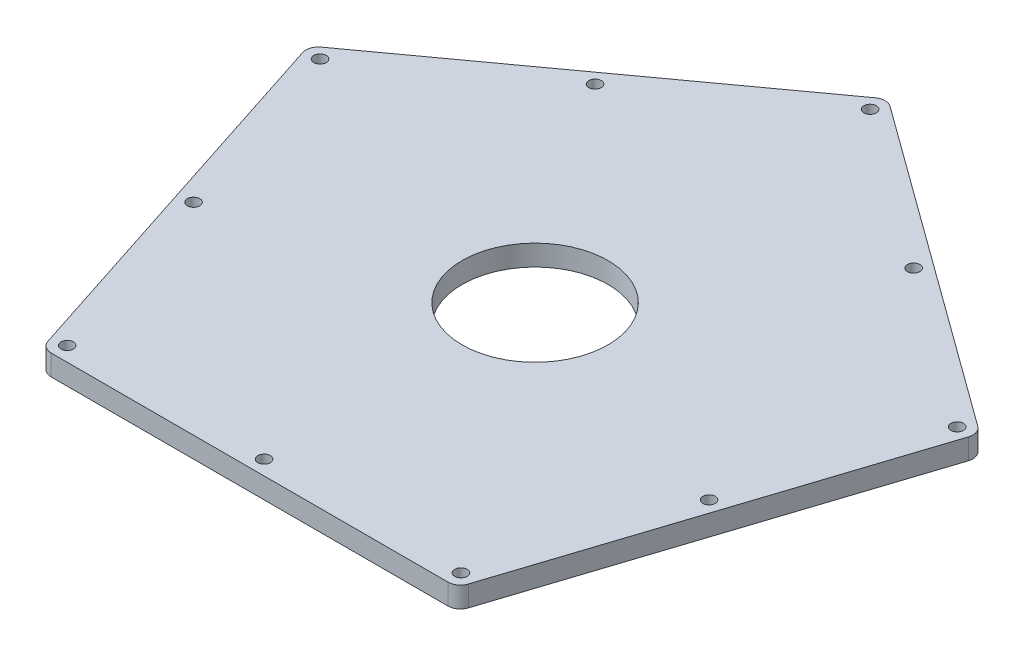
ISO-10303-21;
HEADER;
FILE_DESCRIPTION(('STEP AP214'),'2;1');
FILE_NAME('part.step','',(''),(''),'','','');
FILE_SCHEMA(('AUTOMOTIVE_DESIGN { 1 0 10303 214 1 1 1 1 }'));
ENDSEC;
DATA;
#1=APPLICATION_CONTEXT('core data for automotive mechanical design processes');
#2=APPLICATION_PROTOCOL_DEFINITION('international standard','automotive_design',2000,#1);
#3=PRODUCT_CONTEXT('',#1,'mechanical');
#4=PRODUCT('Part','Part','',(#3));
#5=PRODUCT_RELATED_PRODUCT_CATEGORY('part','',(#4));
#6=PRODUCT_DEFINITION_FORMATION('','',#4);
#7=PRODUCT_DEFINITION_CONTEXT('part definition',#1,'design');
#8=PRODUCT_DEFINITION('design','',#6,#7);
#9=PRODUCT_DEFINITION_SHAPE('','',#8);
#10=(LENGTH_UNIT() NAMED_UNIT(*) SI_UNIT(.MILLI.,.METRE.));
#11=(NAMED_UNIT(*) PLANE_ANGLE_UNIT() SI_UNIT($,.RADIAN.));
#12=(NAMED_UNIT(*) SI_UNIT($,.STERADIAN.) SOLID_ANGLE_UNIT());
#13=UNCERTAINTY_MEASURE_WITH_UNIT(LENGTH_MEASURE(1.E-05),#10,'distance_accuracy_value','');
#14=(GEOMETRIC_REPRESENTATION_CONTEXT(3) GLOBAL_UNCERTAINTY_ASSIGNED_CONTEXT((#13)) GLOBAL_UNIT_ASSIGNED_CONTEXT((#10,
#11,#12)) REPRESENTATION_CONTEXT('',''));
#15=CARTESIAN_POINT('',(0.,0.,0.));
#16=DIRECTION('',(0.,0.,1.));
#17=DIRECTION('',(1.,0.,0.));
#18=AXIS2_PLACEMENT_3D('',#15,#16,#17);
#19=CARTESIAN_POINT('',(0.,-5.,0.));
#20=DIRECTION('',(0.,1.,0.));
#21=DIRECTION('',(0.,0.,1.));
#22=AXIS2_PLACEMENT_3D('',#19,#20,#21);
#23=PLANE('',#22);
#24=CARTESIAN_POINT('',(0.,-5.,0.));
#25=DIRECTION('',(0.,1.,0.));
#26=DIRECTION('',(0.,0.,1.));
#27=AXIS2_PLACEMENT_3D('',#24,#25,#26);
#28=CIRCLE('',#27,17.6);
#29=CARTESIAN_POINT('',(0.,-5.,17.6));
#30=VERTEX_POINT('',#29);
#31=EDGE_CURVE('E325',#30,#30,#28,.T.);
#32=ORIENTED_EDGE('',*,*,#31,.F.);
#33=EDGE_LOOP('',(#32));
#34=FACE_BOUND('',#33,.T.);
#35=CARTESIAN_POINT('',(76.7872026714474,-5.,-24.9496745665813));
#36=DIRECTION('',(0.,1.,0.));
#37=DIRECTION('',(0.,0.,1.));
#38=AXIS2_PLACEMENT_3D('',#35,#36,#37);
#39=CIRCLE('',#38,1.5);
#40=CARTESIAN_POINT('',(76.7872026714474,-5.,-23.4496745665813));
#41=VERTEX_POINT('',#40);
#42=EDGE_CURVE('E305',#41,#41,#39,.T.);
#43=ORIENTED_EDGE('',*,*,#42,.F.);
#44=EDGE_LOOP('',(#43));
#45=FACE_BOUND('',#44,.T.);
#46=CARTESIAN_POINT('',(-38.3936013357237,-5.,-52.844258740268));
#47=DIRECTION('',(0.,1.,0.));
#48=DIRECTION('',(0.,0.,1.));
#49=AXIS2_PLACEMENT_3D('',#46,#47,#48);
#50=CIRCLE('',#49,1.5);
#51=CARTESIAN_POINT('',(-38.3936013357237,-5.,-51.344258740268));
#52=VERTEX_POINT('',#51);
#53=EDGE_CURVE('E289',#52,#52,#50,.T.);
#54=ORIENTED_EDGE('',*,*,#53,.F.);
#55=EDGE_LOOP('',(#54));
#56=FACE_BOUND('',#55,.T.);
#57=CARTESIAN_POINT('',(-62.1221519117143,-5.,20.1847107284887));
#58=DIRECTION('',(0.,1.,0.));
#59=DIRECTION('',(0.,0.,1.));
#60=AXIS2_PLACEMENT_3D('',#57,#58,#59);
#61=CIRCLE('',#60,1.5);
#62=CARTESIAN_POINT('',(-62.1221519117143,-5.,21.6847107284887));
#63=VERTEX_POINT('',#62);
#64=EDGE_CURVE('E273',#63,#63,#61,.T.);
#65=ORIENTED_EDGE('',*,*,#64,.F.);
#66=EDGE_LOOP('',(#65));
#67=FACE_BOUND('',#66,.T.);
#68=CARTESIAN_POINT('',(0.,-5.,65.3190960235587));
#69=DIRECTION('',(0.,1.,0.));
#70=DIRECTION('',(0.,0.,1.));
#71=AXIS2_PLACEMENT_3D('',#68,#69,#70);
#72=CIRCLE('',#71,1.5);
#73=CARTESIAN_POINT('',(0.,-5.,66.8190960235587));
#74=VERTEX_POINT('',#73);
#75=EDGE_CURVE('E257',#74,#74,#72,.T.);
#76=ORIENTED_EDGE('',*,*,#75,.F.);
#77=EDGE_LOOP('',(#76));
#78=FACE_BOUND('',#77,.T.);
#79=CARTESIAN_POINT('',(62.1221519117143,-5.,20.1847107284887));
#80=DIRECTION('',(0.,1.,0.));
#81=DIRECTION('',(0.,0.,1.));
#82=AXIS2_PLACEMENT_3D('',#79,#80,#81);
#83=CIRCLE('',#82,1.49999999999999);
#84=CARTESIAN_POINT('',(62.1221519117143,-5.,21.6847107284887));
#85=VERTEX_POINT('',#84);
#86=EDGE_CURVE('E232',#85,#85,#83,.T.);
#87=ORIENTED_EDGE('',*,*,#86,.F.);
#88=EDGE_LOOP('',(#87));
#89=FACE_BOUND('',#88,.T.);
#90=DIRECTION('',(0.309016994374947,0.,0.951056516295154));
#91=VECTOR('',#90,1.);
#92=CARTESIAN_POINT('',(-80.9016994374948,-5.,-26.2865556059567));
#93=LINE('',#92,#91);
#94=CARTESIAN_POINT('',(-80.2281574726254,-5.,-24.2136065890815));
#95=VERTEX_POINT('',#94);
#96=CARTESIAN_POINT('',(-50.6735419648694,-5.,66.7461470066835));
#97=VERTEX_POINT('',#96);
#98=EDGE_CURVE('E237',#95,#97,#93,.T.);
#99=ORIENTED_EDGE('',*,*,#98,.T.);
#100=CARTESIAN_POINT('',(-47.8203724159839,-5.,65.8190960235587));
#101=DIRECTION('',(0.,1.,0.));
#102=DIRECTION('',(0.,0.,1.));
#103=AXIS2_PLACEMENT_3D('',#100,#101,#102);
#104=CIRCLE('',#103,3.);
#105=CARTESIAN_POINT('',(-47.8203724159839,-5.,68.8190960235587));
#106=VERTEX_POINT('',#105);
#107=EDGE_CURVE('E191',#97,#106,#104,.T.);
#108=ORIENTED_EDGE('',*,*,#107,.T.);
#109=DIRECTION('',(1.,0.,0.));
#110=VECTOR('',#109,1.);
#111=CARTESIAN_POINT('',(-50.,-5.,68.8190960235587));
#112=LINE('',#111,#110);
#113=CARTESIAN_POINT('',(47.8203724159839,-5.,68.8190960235587));
#114=VERTEX_POINT('',#113);
#115=EDGE_CURVE('E142',#106,#114,#112,.T.);
#116=ORIENTED_EDGE('',*,*,#115,.T.);
#117=CARTESIAN_POINT('',(47.8203724159839,-5.,65.8190960235587));
#118=DIRECTION('',(0.,1.,0.));
#119=DIRECTION('',(0.,0.,1.));
#120=AXIS2_PLACEMENT_3D('',#117,#118,#119);
#121=CIRCLE('',#120,3.);
#122=CARTESIAN_POINT('',(50.6735419648694,-5.,66.7461470066835));
#123=VERTEX_POINT('',#122);
#124=EDGE_CURVE('E183',#114,#123,#121,.T.);
#125=ORIENTED_EDGE('',*,*,#124,.T.);
#126=DIRECTION('',(0.309016994374948,0.,-0.951056516295154));
#127=VECTOR('',#126,1.);
#128=CARTESIAN_POINT('',(50.,-5.,68.8190960235587));
#129=LINE('',#128,#127);
#130=CARTESIAN_POINT('',(80.2281574726254,-5.,-24.2136065890815));
#131=VERTEX_POINT('',#130);
#132=EDGE_CURVE('E152',#123,#131,#129,.T.);
#133=ORIENTED_EDGE('',*,*,#132,.T.);
#134=CARTESIAN_POINT('',(77.3749879237399,-5.,-25.1406575722064));
#135=DIRECTION('',(0.,1.,0.));
#136=DIRECTION('',(0.,0.,1.));
#137=AXIS2_PLACEMENT_3D('',#134,#135,#136);
#138=CIRCLE('',#137,3.);
#139=CARTESIAN_POINT('',(79.1383436806173,-5.,-27.5677085553312));
#140=VERTEX_POINT('',#139);
#141=EDGE_CURVE('E180',#131,#140,#138,.T.);
#142=ORIENTED_EDGE('',*,*,#141,.T.);
#143=DIRECTION('',(-0.809016994374947,0.,-0.587785252292473));
#144=VECTOR('',#143,1.);
#145=CARTESIAN_POINT('',(80.9016994374948,-5.,-26.2865556059567));
#146=LINE('',#145,#144);
#147=CARTESIAN_POINT('',(1.76335575687742,-5.,-83.7839278858295));
#148=VERTEX_POINT('',#147);
#149=EDGE_CURVE('E158',#140,#148,#146,.T.);
#150=ORIENTED_EDGE('',*,*,#149,.T.);
#151=CARTESIAN_POINT('',(0.,-5.,-81.3568769027046));
#152=DIRECTION('',(0.,1.,0.));
#153=DIRECTION('',(0.,0.,1.));
#154=AXIS2_PLACEMENT_3D('',#151,#152,#153);
#155=CIRCLE('',#154,3.);
#156=CARTESIAN_POINT('',(-1.7633557568774,-5.,-83.7839278858295));
#157=VERTEX_POINT('',#156);
#158=EDGE_CURVE('E64',#148,#157,#155,.T.);
#159=ORIENTED_EDGE('',*,*,#158,.T.);
#160=DIRECTION('',(-0.809016994374947,0.,0.587785252292473));
#161=VECTOR('',#160,1.);
#162=CARTESIAN_POINT('',(0.,-5.,-85.065080835204));
#163=LINE('',#162,#161);
#164=CARTESIAN_POINT('',(-79.1383436806173,-5.,-27.5677085553312));
#165=VERTEX_POINT('',#164);
#166=EDGE_CURVE('E240',#157,#165,#163,.T.);
#167=ORIENTED_EDGE('',*,*,#166,.T.);
#168=CARTESIAN_POINT('',(-77.3749879237399,-5.,-25.1406575722064));
#169=DIRECTION('',(0.,1.,0.));
#170=DIRECTION('',(0.,0.,1.));
#171=AXIS2_PLACEMENT_3D('',#168,#169,#170);
#172=CIRCLE('',#171,3.);
#173=EDGE_CURVE('E188',#165,#95,#172,.T.);
#174=ORIENTED_EDGE('',*,*,#173,.T.);
#175=EDGE_LOOP('',(#99,#108,#116,#125,#133,#142,#150,#159,#167,#174));
#176=FACE_BOUND('',#175,.T.);
#177=CARTESIAN_POINT('',(47.4571011519812,-5.,65.3190960235587));
#178=DIRECTION('',(0.,1.,0.));
#179=DIRECTION('',(0.,0.,1.));
#180=AXIS2_PLACEMENT_3D('',#177,#178,#179);
#181=CIRCLE('',#180,1.5);
#182=CARTESIAN_POINT('',(47.4571011519812,-5.,66.8190960235587));
#183=VERTEX_POINT('',#182);
#184=EDGE_CURVE('E249',#183,#183,#181,.T.);
#185=ORIENTED_EDGE('',*,*,#184,.F.);
#186=EDGE_LOOP('',(#185));
#187=FACE_BOUND('',#186,.T.);
#188=CARTESIAN_POINT('',(-47.4571011519812,-5.,65.3190960235587));
#189=DIRECTION('',(0.,1.,0.));
#190=DIRECTION('',(0.,0.,1.));
#191=AXIS2_PLACEMENT_3D('',#188,#189,#190);
#192=CIRCLE('',#191,1.5);
#193=CARTESIAN_POINT('',(-47.4571011519812,-5.,66.8190960235587));
#194=VERTEX_POINT('',#193);
#195=EDGE_CURVE('E265',#194,#194,#192,.T.);
#196=ORIENTED_EDGE('',*,*,#195,.F.);
#197=EDGE_LOOP('',(#196));
#198=FACE_BOUND('',#197,.T.);
#199=CARTESIAN_POINT('',(-76.7872026714474,-5.,-24.9496745665813));
#200=DIRECTION('',(0.,1.,0.));
#201=DIRECTION('',(0.,0.,1.));
#202=AXIS2_PLACEMENT_3D('',#199,#200,#201);
#203=CIRCLE('',#202,1.5);
#204=CARTESIAN_POINT('',(-76.7872026714474,-5.,-23.4496745665813));
#205=VERTEX_POINT('',#204);
#206=EDGE_CURVE('E281',#205,#205,#203,.T.);
#207=ORIENTED_EDGE('',*,*,#206,.F.);
#208=EDGE_LOOP('',(#207));
#209=FACE_BOUND('',#208,.T.);
#210=CARTESIAN_POINT('',(0.,-5.,-80.7388429139547));
#211=DIRECTION('',(0.,1.,0.));
#212=DIRECTION('',(0.,0.,1.));
#213=AXIS2_PLACEMENT_3D('',#210,#211,#212);
#214=CIRCLE('',#213,1.5);
#215=CARTESIAN_POINT('',(0.,-5.,-79.2388429139547));
#216=VERTEX_POINT('',#215);
#217=EDGE_CURVE('E297',#216,#216,#214,.T.);
#218=ORIENTED_EDGE('',*,*,#217,.F.);
#219=EDGE_LOOP('',(#218));
#220=FACE_BOUND('',#219,.T.);
#221=CARTESIAN_POINT('',(38.3936013357237,-5.,-52.844258740268));
#222=DIRECTION('',(0.,1.,0.));
#223=DIRECTION('',(0.,0.,1.));
#224=AXIS2_PLACEMENT_3D('',#221,#222,#223);
#225=CIRCLE('',#224,1.5);
#226=CARTESIAN_POINT('',(38.3936013357237,-5.,-51.344258740268));
#227=VERTEX_POINT('',#226);
#228=EDGE_CURVE('E313',#227,#227,#225,.T.);
#229=ORIENTED_EDGE('',*,*,#228,.F.);
#230=EDGE_LOOP('',(#229));
#231=FACE_BOUND('',#230,.T.);
#232=ADVANCED_FACE('F41',(#34,#45,#56,#67,#78,#89,#176,#187,#198,#209,#220,#231),#23,.T.);
#233=CARTESIAN_POINT('',(0.,-10.,0.));
#234=DIRECTION('',(0.,1.,0.));
#235=DIRECTION('',(0.,0.,1.));
#236=AXIS2_PLACEMENT_3D('',#233,#234,#235);
#237=PLANE('',#236);
#238=CARTESIAN_POINT('',(0.,-10.,0.));
#239=DIRECTION('',(0.,1.,0.));
#240=DIRECTION('',(0.,0.,1.));
#241=AXIS2_PLACEMENT_3D('',#238,#239,#240);
#242=CIRCLE('',#241,17.6);
#243=CARTESIAN_POINT('',(0.,-10.,17.6));
#244=VERTEX_POINT('',#243);
#245=EDGE_CURVE('E321',#244,#244,#242,.T.);
#246=ORIENTED_EDGE('',*,*,#245,.T.);
#247=EDGE_LOOP('',(#246));
#248=FACE_BOUND('',#247,.T.);
#249=DIRECTION('',(1.,0.,0.));
#250=VECTOR('',#249,1.);
#251=CARTESIAN_POINT('',(-50.,-10.,68.8190960235587));
#252=LINE('',#251,#250);
#253=CARTESIAN_POINT('',(-47.8203724159839,-10.,68.8190960235587));
#254=VERTEX_POINT('',#253);
#255=CARTESIAN_POINT('',(47.8203724159839,-10.,68.8190960235587));
#256=VERTEX_POINT('',#255);
#257=EDGE_CURVE('E139',#254,#256,#252,.T.);
#258=ORIENTED_EDGE('',*,*,#257,.F.);
#259=CARTESIAN_POINT('',(-47.8203724159839,-10.,65.8190960235587));
#260=DIRECTION('',(0.,1.,0.));
#261=DIRECTION('',(0.,0.,1.));
#262=AXIS2_PLACEMENT_3D('',#259,#260,#261);
#263=CIRCLE('',#262,3.);
#264=CARTESIAN_POINT('',(-50.6735419648694,-10.,66.7461470066835));
#265=VERTEX_POINT('',#264);
#266=EDGE_CURVE('E121',#254,#265,#263,.F.);
#267=ORIENTED_EDGE('',*,*,#266,.T.);
#268=DIRECTION('',(0.309016994374947,0.,0.951056516295154));
#269=VECTOR('',#268,1.);
#270=CARTESIAN_POINT('',(-80.9016994374948,-10.,-26.2865556059567));
#271=LINE('',#270,#269);
#272=CARTESIAN_POINT('',(-80.2281574726254,-10.,-24.2136065890815));
#273=VERTEX_POINT('',#272);
#274=EDGE_CURVE('E153',#273,#265,#271,.T.);
#275=ORIENTED_EDGE('',*,*,#274,.F.);
#276=CARTESIAN_POINT('',(-77.3749879237399,-10.,-25.1406575722064));
#277=DIRECTION('',(0.,1.,0.));
#278=DIRECTION('',(0.,0.,1.));
#279=AXIS2_PLACEMENT_3D('',#276,#277,#278);
#280=CIRCLE('',#279,3.);
#281=CARTESIAN_POINT('',(-79.1383436806173,-10.,-27.5677085553312));
#282=VERTEX_POINT('',#281);
#283=EDGE_CURVE('E133',#273,#282,#280,.F.);
#284=ORIENTED_EDGE('',*,*,#283,.T.);
#285=DIRECTION('',(-0.809016994374947,0.,0.587785252292473));
#286=VECTOR('',#285,1.);
#287=CARTESIAN_POINT('',(0.,-10.,-85.065080835204));
#288=LINE('',#287,#286);
#289=CARTESIAN_POINT('',(-1.7633557568774,-10.,-83.7839278858295));
#290=VERTEX_POINT('',#289);
#291=EDGE_CURVE('E160',#290,#282,#288,.T.);
#292=ORIENTED_EDGE('',*,*,#291,.F.);
#293=CARTESIAN_POINT('',(0.,-10.,-81.3568769027046));
#294=DIRECTION('',(0.,1.,0.));
#295=DIRECTION('',(0.,0.,1.));
#296=AXIS2_PLACEMENT_3D('',#293,#294,#295);
#297=CIRCLE('',#296,3.);
#298=CARTESIAN_POINT('',(1.76335575687742,-10.,-83.7839278858295));
#299=VERTEX_POINT('',#298);
#300=EDGE_CURVE('E170',#290,#299,#297,.F.);
#301=ORIENTED_EDGE('',*,*,#300,.T.);
#302=DIRECTION('',(-0.809016994374947,0.,-0.587785252292473));
#303=VECTOR('',#302,1.);
#304=CARTESIAN_POINT('',(80.9016994374948,-10.,-26.2865556059567));
#305=LINE('',#304,#303);
#306=CARTESIAN_POINT('',(79.1383436806173,-10.,-27.5677085553312));
#307=VERTEX_POINT('',#306);
#308=EDGE_CURVE('E225',#307,#299,#305,.T.);
#309=ORIENTED_EDGE('',*,*,#308,.F.);
#310=CARTESIAN_POINT('',(77.3749879237399,-10.,-25.1406575722064));
#311=DIRECTION('',(0.,1.,0.));
#312=DIRECTION('',(0.,0.,1.));
#313=AXIS2_PLACEMENT_3D('',#310,#311,#312);
#314=CIRCLE('',#313,3.);
#315=CARTESIAN_POINT('',(80.2281574726254,-10.,-24.2136065890815));
#316=VERTEX_POINT('',#315);
#317=EDGE_CURVE('E144',#307,#316,#314,.F.);
#318=ORIENTED_EDGE('',*,*,#317,.T.);
#319=DIRECTION('',(0.309016994374948,0.,-0.951056516295154));
#320=VECTOR('',#319,1.);
#321=CARTESIAN_POINT('',(50.,-10.,68.8190960235587));
#322=LINE('',#321,#320);
#323=CARTESIAN_POINT('',(50.6735419648694,-10.,66.7461470066835));
#324=VERTEX_POINT('',#323);
#325=EDGE_CURVE('E213',#324,#316,#322,.T.);
#326=ORIENTED_EDGE('',*,*,#325,.F.);
#327=CARTESIAN_POINT('',(47.8203724159839,-10.,65.8190960235587));
#328=DIRECTION('',(0.,1.,0.));
#329=DIRECTION('',(0.,0.,1.));
#330=AXIS2_PLACEMENT_3D('',#327,#328,#329);
#331=CIRCLE('',#330,3.);
#332=EDGE_CURVE('E150',#324,#256,#331,.F.);
#333=ORIENTED_EDGE('',*,*,#332,.T.);
#334=EDGE_LOOP('',(#258,#267,#275,#284,#292,#301,#309,#318,#326,#333));
#335=FACE_BOUND('',#334,.T.);
#336=CARTESIAN_POINT('',(62.1221519117143,-10.,20.1847107284887));
#337=DIRECTION('',(0.,1.,0.));
#338=DIRECTION('',(0.,0.,1.));
#339=AXIS2_PLACEMENT_3D('',#336,#337,#338);
#340=CIRCLE('',#339,1.49999999999999);
#341=CARTESIAN_POINT('',(62.1221519117143,-10.,21.6847107284887));
#342=VERTEX_POINT('',#341);
#343=EDGE_CURVE('E245',#342,#342,#340,.T.);
#344=ORIENTED_EDGE('',*,*,#343,.T.);
#345=EDGE_LOOP('',(#344));
#346=FACE_BOUND('',#345,.T.);
#347=CARTESIAN_POINT('',(47.4571011519812,-10.,65.3190960235587));
#348=DIRECTION('',(0.,1.,0.));
#349=DIRECTION('',(0.,0.,1.));
#350=AXIS2_PLACEMENT_3D('',#347,#348,#349);
#351=CIRCLE('',#350,1.5);
#352=CARTESIAN_POINT('',(47.4571011519812,-10.,66.8190960235587));
#353=VERTEX_POINT('',#352);
#354=EDGE_CURVE('E253',#353,#353,#351,.T.);
#355=ORIENTED_EDGE('',*,*,#354,.T.);
#356=EDGE_LOOP('',(#355));
#357=FACE_BOUND('',#356,.T.);
#358=CARTESIAN_POINT('',(0.,-10.,65.3190960235587));
#359=DIRECTION('',(0.,1.,0.));
#360=DIRECTION('',(0.,0.,1.));
#361=AXIS2_PLACEMENT_3D('',#358,#359,#360);
#362=CIRCLE('',#361,1.5);
#363=CARTESIAN_POINT('',(0.,-10.,66.8190960235587));
#364=VERTEX_POINT('',#363);
#365=EDGE_CURVE('E261',#364,#364,#362,.T.);
#366=ORIENTED_EDGE('',*,*,#365,.T.);
#367=EDGE_LOOP('',(#366));
#368=FACE_BOUND('',#367,.T.);
#369=CARTESIAN_POINT('',(-47.4571011519812,-10.,65.3190960235587));
#370=DIRECTION('',(0.,1.,0.));
#371=DIRECTION('',(0.,0.,1.));
#372=AXIS2_PLACEMENT_3D('',#369,#370,#371);
#373=CIRCLE('',#372,1.5);
#374=CARTESIAN_POINT('',(-47.4571011519812,-10.,66.8190960235587));
#375=VERTEX_POINT('',#374);
#376=EDGE_CURVE('E269',#375,#375,#373,.T.);
#377=ORIENTED_EDGE('',*,*,#376,.T.);
#378=EDGE_LOOP('',(#377));
#379=FACE_BOUND('',#378,.T.);
#380=CARTESIAN_POINT('',(-62.1221519117143,-10.,20.1847107284887));
#381=DIRECTION('',(0.,1.,0.));
#382=DIRECTION('',(0.,0.,1.));
#383=AXIS2_PLACEMENT_3D('',#380,#381,#382);
#384=CIRCLE('',#383,1.5);
#385=CARTESIAN_POINT('',(-62.1221519117143,-10.,21.6847107284887));
#386=VERTEX_POINT('',#385);
#387=EDGE_CURVE('E277',#386,#386,#384,.T.);
#388=ORIENTED_EDGE('',*,*,#387,.T.);
#389=EDGE_LOOP('',(#388));
#390=FACE_BOUND('',#389,.T.);
#391=CARTESIAN_POINT('',(-76.7872026714474,-10.,-24.9496745665813));
#392=DIRECTION('',(0.,1.,0.));
#393=DIRECTION('',(0.,0.,1.));
#394=AXIS2_PLACEMENT_3D('',#391,#392,#393);
#395=CIRCLE('',#394,1.5);
#396=CARTESIAN_POINT('',(-76.7872026714474,-10.,-23.4496745665813));
#397=VERTEX_POINT('',#396);
#398=EDGE_CURVE('E285',#397,#397,#395,.T.);
#399=ORIENTED_EDGE('',*,*,#398,.T.);
#400=EDGE_LOOP('',(#399));
#401=FACE_BOUND('',#400,.T.);
#402=CARTESIAN_POINT('',(-38.3936013357237,-10.,-52.844258740268));
#403=DIRECTION('',(0.,1.,0.));
#404=DIRECTION('',(0.,0.,1.));
#405=AXIS2_PLACEMENT_3D('',#402,#403,#404);
#406=CIRCLE('',#405,1.5);
#407=CARTESIAN_POINT('',(-38.3936013357237,-10.,-51.344258740268));
#408=VERTEX_POINT('',#407);
#409=EDGE_CURVE('E293',#408,#408,#406,.T.);
#410=ORIENTED_EDGE('',*,*,#409,.T.);
#411=EDGE_LOOP('',(#410));
#412=FACE_BOUND('',#411,.T.);
#413=CARTESIAN_POINT('',(0.,-10.,-80.7388429139547));
#414=DIRECTION('',(0.,1.,0.));
#415=DIRECTION('',(0.,0.,1.));
#416=AXIS2_PLACEMENT_3D('',#413,#414,#415);
#417=CIRCLE('',#416,1.5);
#418=CARTESIAN_POINT('',(0.,-10.,-79.2388429139547));
#419=VERTEX_POINT('',#418);
#420=EDGE_CURVE('E301',#419,#419,#417,.T.);
#421=ORIENTED_EDGE('',*,*,#420,.T.);
#422=EDGE_LOOP('',(#421));
#423=FACE_BOUND('',#422,.T.);
#424=CARTESIAN_POINT('',(76.7872026714474,-10.,-24.9496745665813));
#425=DIRECTION('',(0.,1.,0.));
#426=DIRECTION('',(0.,0.,1.));
#427=AXIS2_PLACEMENT_3D('',#424,#425,#426);
#428=CIRCLE('',#427,1.5);
#429=CARTESIAN_POINT('',(76.7872026714474,-10.,-23.4496745665813));
#430=VERTEX_POINT('',#429);
#431=EDGE_CURVE('E309',#430,#430,#428,.T.);
#432=ORIENTED_EDGE('',*,*,#431,.T.);
#433=EDGE_LOOP('',(#432));
#434=FACE_BOUND('',#433,.T.);
#435=CARTESIAN_POINT('',(38.3936013357237,-10.,-52.844258740268));
#436=DIRECTION('',(0.,1.,0.));
#437=DIRECTION('',(0.,0.,1.));
#438=AXIS2_PLACEMENT_3D('',#435,#436,#437);
#439=CIRCLE('',#438,1.5);
#440=CARTESIAN_POINT('',(38.3936013357237,-10.,-51.344258740268));
#441=VERTEX_POINT('',#440);
#442=EDGE_CURVE('E317',#441,#441,#439,.T.);
#443=ORIENTED_EDGE('',*,*,#442,.T.);
#444=EDGE_LOOP('',(#443));
#445=FACE_BOUND('',#444,.T.);
#446=ADVANCED_FACE('F147',(#248,#335,#346,#357,#368,#379,#390,#401,#412,#423,#434,#445),#237,.F.);
#447=CARTESIAN_POINT('',(50.,-5.,68.8190960235587));
#448=DIRECTION('',(-0.951056516295154,0.,-0.309016994374948));
#449=DIRECTION('',(-0.309016994374948,0.,0.951056516295154));
#450=AXIS2_PLACEMENT_3D('',#447,#448,#449);
#451=PLANE('',#450);
#452=ORIENTED_EDGE('',*,*,#132,.F.);
#453=DIRECTION('',(0.,-1.,0.));
#454=VECTOR('',#453,1.);
#455=CARTESIAN_POINT('',(50.6735419648694,-5.,66.7461470066835));
#456=LINE('',#455,#454);
#457=EDGE_CURVE('E11',#123,#324,#456,.T.);
#458=ORIENTED_EDGE('',*,*,#457,.T.);
#459=ORIENTED_EDGE('',*,*,#325,.T.);
#460=DIRECTION('',(0.,-1.,0.));
#461=VECTOR('',#460,1.);
#462=CARTESIAN_POINT('',(80.2281574726254,-5.,-24.2136065890815));
#463=LINE('',#462,#461);
#464=EDGE_CURVE('E50',#316,#131,#463,.F.);
#465=ORIENTED_EDGE('',*,*,#464,.T.);
#466=EDGE_LOOP('',(#452,#458,#459,#465));
#467=FACE_BOUND('',#466,.T.);
#468=ADVANCED_FACE('F211',(#467),#451,.F.);
#469=CARTESIAN_POINT('',(80.9016994374948,-5.,-26.2865556059567));
#470=DIRECTION('',(-0.587785252292473,0.,0.809016994374947));
#471=DIRECTION('',(0.809016994374947,0.,0.587785252292473));
#472=AXIS2_PLACEMENT_3D('',#469,#470,#471);
#473=PLANE('',#472);
#474=ORIENTED_EDGE('',*,*,#308,.T.);
#475=DIRECTION('',(0.,-1.,0.));
#476=VECTOR('',#475,1.);
#477=CARTESIAN_POINT('',(1.76335575687744,-5.,-83.7839278858295));
#478=LINE('',#477,#476);
#479=EDGE_CURVE('E204',#299,#148,#478,.F.);
#480=ORIENTED_EDGE('',*,*,#479,.T.);
#481=ORIENTED_EDGE('',*,*,#149,.F.);
#482=DIRECTION('',(0.,-1.,0.));
#483=VECTOR('',#482,1.);
#484=CARTESIAN_POINT('',(79.1383436806173,-5.,-27.5677085553312));
#485=LINE('',#484,#483);
#486=EDGE_CURVE('E200',#140,#307,#485,.T.);
#487=ORIENTED_EDGE('',*,*,#486,.T.);
#488=EDGE_LOOP('',(#474,#480,#481,#487));
#489=FACE_BOUND('',#488,.T.);
#490=ADVANCED_FACE('F224',(#489),#473,.F.);
#491=CARTESIAN_POINT('',(0.,-5.,-85.065080835204));
#492=DIRECTION('',(0.587785252292473,0.,0.809016994374947));
#493=DIRECTION('',(0.809016994374948,0.,-0.587785252292473));
#494=AXIS2_PLACEMENT_3D('',#491,#492,#493);
#495=PLANE('',#494);
#496=ORIENTED_EDGE('',*,*,#291,.T.);
#497=DIRECTION('',(0.,-1.,0.));
#498=VECTOR('',#497,1.);
#499=CARTESIAN_POINT('',(-79.1383436806173,-5.,-27.5677085553312));
#500=LINE('',#499,#498);
#501=EDGE_CURVE('E57',#282,#165,#500,.F.);
#502=ORIENTED_EDGE('',*,*,#501,.T.);
#503=ORIENTED_EDGE('',*,*,#166,.F.);
#504=DIRECTION('',(0.,-1.,0.));
#505=VECTOR('',#504,1.);
#506=CARTESIAN_POINT('',(-1.7633557568774,-5.,-83.7839278858295));
#507=LINE('',#506,#505);
#508=EDGE_CURVE('E194',#157,#290,#507,.T.);
#509=ORIENTED_EDGE('',*,*,#508,.T.);
#510=EDGE_LOOP('',(#496,#502,#503,#509));
#511=FACE_BOUND('',#510,.T.);
#512=ADVANCED_FACE('F423',(#511),#495,.F.);
#513=CARTESIAN_POINT('',(-80.9016994374948,-5.,-26.2865556059567));
#514=DIRECTION('',(0.951056516295154,0.,-0.309016994374947));
#515=DIRECTION('',(-0.309016994374947,0.,-0.951056516295154));
#516=AXIS2_PLACEMENT_3D('',#513,#514,#515);
#517=PLANE('',#516);
#518=ORIENTED_EDGE('',*,*,#274,.T.);
#519=DIRECTION('',(0.,-1.,0.));
#520=VECTOR('',#519,1.);
#521=CARTESIAN_POINT('',(-50.6735419648694,-5.,66.7461470066835));
#522=LINE('',#521,#520);
#523=EDGE_CURVE('E126',#265,#97,#522,.F.);
#524=ORIENTED_EDGE('',*,*,#523,.T.);
#525=ORIENTED_EDGE('',*,*,#98,.F.);
#526=DIRECTION('',(0.,-1.,0.));
#527=VECTOR('',#526,1.);
#528=CARTESIAN_POINT('',(-80.2281574726254,-5.,-24.2136065890815));
#529=LINE('',#528,#527);
#530=EDGE_CURVE('E132',#95,#273,#529,.T.);
#531=ORIENTED_EDGE('',*,*,#530,.T.);
#532=EDGE_LOOP('',(#518,#524,#525,#531));
#533=FACE_BOUND('',#532,.T.);
#534=ADVANCED_FACE('F420',(#533),#517,.F.);
#535=CARTESIAN_POINT('',(-50.,-5.,68.8190960235587));
#536=DIRECTION('',(0.,0.,-1.));
#537=DIRECTION('',(-1.,0.,0.));
#538=AXIS2_PLACEMENT_3D('',#535,#536,#537);
#539=PLANE('',#538);
#540=ORIENTED_EDGE('',*,*,#115,.F.);
#541=DIRECTION('',(0.,-1.,0.));
#542=VECTOR('',#541,1.);
#543=CARTESIAN_POINT('',(-47.8203724159839,-5.,68.8190960235587));
#544=LINE('',#543,#542);
#545=EDGE_CURVE('E125',#106,#254,#544,.T.);
#546=ORIENTED_EDGE('',*,*,#545,.T.);
#547=ORIENTED_EDGE('',*,*,#257,.T.);
#548=DIRECTION('',(0.,-1.,0.));
#549=VECTOR('',#548,1.);
#550=CARTESIAN_POINT('',(47.8203724159839,-5.,68.8190960235587));
#551=LINE('',#550,#549);
#552=EDGE_CURVE('E145',#256,#114,#551,.F.);
#553=ORIENTED_EDGE('',*,*,#552,.T.);
#554=EDGE_LOOP('',(#540,#546,#547,#553));
#555=FACE_BOUND('',#554,.T.);
#556=ADVANCED_FACE('F138',(#555),#539,.F.);
#557=CARTESIAN_POINT('',(62.1221519117143,-5.,20.1847107284887));
#558=DIRECTION('',(0.,-1.,0.));
#559=DIRECTION('',(0.,0.,-1.));
#560=AXIS2_PLACEMENT_3D('',#557,#558,#559);
#561=CYLINDRICAL_SURFACE('',#560,1.49999999999999);
#562=ORIENTED_EDGE('',*,*,#86,.T.);
#563=EDGE_LOOP('',(#562));
#564=FACE_BOUND('',#563,.T.);
#565=ORIENTED_EDGE('',*,*,#343,.F.);
#566=EDGE_LOOP('',(#565));
#567=FACE_BOUND('',#566,.T.);
#568=ADVANCED_FACE('F354',(#564,#567),#561,.F.);
#569=CARTESIAN_POINT('',(47.4571011519812,-5.,65.3190960235587));
#570=DIRECTION('',(0.,-1.,0.));
#571=DIRECTION('',(0.,0.,-1.));
#572=AXIS2_PLACEMENT_3D('',#569,#570,#571);
#573=CYLINDRICAL_SURFACE('',#572,1.5);
#574=ORIENTED_EDGE('',*,*,#184,.T.);
#575=EDGE_LOOP('',(#574));
#576=FACE_BOUND('',#575,.T.);
#577=ORIENTED_EDGE('',*,*,#354,.F.);
#578=EDGE_LOOP('',(#577));
#579=FACE_BOUND('',#578,.T.);
#580=ADVANCED_FACE('F357',(#576,#579),#573,.F.);
#581=CARTESIAN_POINT('',(0.,-5.,65.3190960235587));
#582=DIRECTION('',(0.,-1.,0.));
#583=DIRECTION('',(0.,0.,-1.));
#584=AXIS2_PLACEMENT_3D('',#581,#582,#583);
#585=CYLINDRICAL_SURFACE('',#584,1.5);
#586=ORIENTED_EDGE('',*,*,#75,.T.);
#587=EDGE_LOOP('',(#586));
#588=FACE_BOUND('',#587,.T.);
#589=ORIENTED_EDGE('',*,*,#365,.F.);
#590=EDGE_LOOP('',(#589));
#591=FACE_BOUND('',#590,.T.);
#592=ADVANCED_FACE('F410',(#588,#591),#585,.F.);
#593=CARTESIAN_POINT('',(-47.4571011519812,-5.,65.3190960235587));
#594=DIRECTION('',(0.,-1.,0.));
#595=DIRECTION('',(0.,0.,-1.));
#596=AXIS2_PLACEMENT_3D('',#593,#594,#595);
#597=CYLINDRICAL_SURFACE('',#596,1.5);
#598=ORIENTED_EDGE('',*,*,#195,.T.);
#599=EDGE_LOOP('',(#598));
#600=FACE_BOUND('',#599,.T.);
#601=ORIENTED_EDGE('',*,*,#376,.F.);
#602=EDGE_LOOP('',(#601));
#603=FACE_BOUND('',#602,.T.);
#604=ADVANCED_FACE('F406',(#600,#603),#597,.F.);
#605=CARTESIAN_POINT('',(-62.1221519117143,-5.,20.1847107284887));
#606=DIRECTION('',(0.,-1.,0.));
#607=DIRECTION('',(0.,0.,-1.));
#608=AXIS2_PLACEMENT_3D('',#605,#606,#607);
#609=CYLINDRICAL_SURFACE('',#608,1.5);
#610=ORIENTED_EDGE('',*,*,#64,.T.);
#611=EDGE_LOOP('',(#610));
#612=FACE_BOUND('',#611,.T.);
#613=ORIENTED_EDGE('',*,*,#387,.F.);
#614=EDGE_LOOP('',(#613));
#615=FACE_BOUND('',#614,.T.);
#616=ADVANCED_FACE('F402',(#612,#615),#609,.F.);
#617=CARTESIAN_POINT('',(-76.7872026714474,-5.,-24.9496745665813));
#618=DIRECTION('',(0.,-1.,0.));
#619=DIRECTION('',(0.,0.,-1.));
#620=AXIS2_PLACEMENT_3D('',#617,#618,#619);
#621=CYLINDRICAL_SURFACE('',#620,1.5);
#622=ORIENTED_EDGE('',*,*,#206,.T.);
#623=EDGE_LOOP('',(#622));
#624=FACE_BOUND('',#623,.T.);
#625=ORIENTED_EDGE('',*,*,#398,.F.);
#626=EDGE_LOOP('',(#625));
#627=FACE_BOUND('',#626,.T.);
#628=ADVANCED_FACE('F398',(#624,#627),#621,.F.);
#629=CARTESIAN_POINT('',(-38.3936013357237,-5.,-52.844258740268));
#630=DIRECTION('',(0.,-1.,0.));
#631=DIRECTION('',(0.,0.,-1.));
#632=AXIS2_PLACEMENT_3D('',#629,#630,#631);
#633=CYLINDRICAL_SURFACE('',#632,1.5);
#634=ORIENTED_EDGE('',*,*,#53,.T.);
#635=EDGE_LOOP('',(#634));
#636=FACE_BOUND('',#635,.T.);
#637=ORIENTED_EDGE('',*,*,#409,.F.);
#638=EDGE_LOOP('',(#637));
#639=FACE_BOUND('',#638,.T.);
#640=ADVANCED_FACE('F394',(#636,#639),#633,.F.);
#641=CARTESIAN_POINT('',(0.,-5.,-80.7388429139547));
#642=DIRECTION('',(0.,-1.,0.));
#643=DIRECTION('',(0.,0.,-1.));
#644=AXIS2_PLACEMENT_3D('',#641,#642,#643);
#645=CYLINDRICAL_SURFACE('',#644,1.5);
#646=ORIENTED_EDGE('',*,*,#217,.T.);
#647=EDGE_LOOP('',(#646));
#648=FACE_BOUND('',#647,.T.);
#649=ORIENTED_EDGE('',*,*,#420,.F.);
#650=EDGE_LOOP('',(#649));
#651=FACE_BOUND('',#650,.T.);
#652=ADVANCED_FACE('F388',(#648,#651),#645,.F.);
#653=CARTESIAN_POINT('',(76.7872026714474,-5.,-24.9496745665813));
#654=DIRECTION('',(0.,-1.,0.));
#655=DIRECTION('',(0.,0.,-1.));
#656=AXIS2_PLACEMENT_3D('',#653,#654,#655);
#657=CYLINDRICAL_SURFACE('',#656,1.5);
#658=ORIENTED_EDGE('',*,*,#42,.T.);
#659=EDGE_LOOP('',(#658));
#660=FACE_BOUND('',#659,.T.);
#661=ORIENTED_EDGE('',*,*,#431,.F.);
#662=EDGE_LOOP('',(#661));
#663=FACE_BOUND('',#662,.T.);
#664=ADVANCED_FACE('F382',(#660,#663),#657,.F.);
#665=CARTESIAN_POINT('',(38.3936013357237,-5.,-52.844258740268));
#666=DIRECTION('',(0.,-1.,0.));
#667=DIRECTION('',(0.,0.,-1.));
#668=AXIS2_PLACEMENT_3D('',#665,#666,#667);
#669=CYLINDRICAL_SURFACE('',#668,1.5);
#670=ORIENTED_EDGE('',*,*,#228,.T.);
#671=EDGE_LOOP('',(#670));
#672=FACE_BOUND('',#671,.T.);
#673=ORIENTED_EDGE('',*,*,#442,.F.);
#674=EDGE_LOOP('',(#673));
#675=FACE_BOUND('',#674,.T.);
#676=ADVANCED_FACE('F337',(#672,#675),#669,.F.);
#677=CARTESIAN_POINT('',(0.,-10.,0.));
#678=DIRECTION('',(0.,1.,0.));
#679=DIRECTION('',(0.,0.,1.));
#680=AXIS2_PLACEMENT_3D('',#677,#678,#679);
#681=CYLINDRICAL_SURFACE('',#680,17.6);
#682=ORIENTED_EDGE('',*,*,#245,.F.);
#683=EDGE_LOOP('',(#682));
#684=FACE_BOUND('',#683,.T.);
#685=ORIENTED_EDGE('',*,*,#31,.T.);
#686=EDGE_LOOP('',(#685));
#687=FACE_BOUND('',#686,.T.);
#688=ADVANCED_FACE('F334',(#684,#687),#681,.F.);
#689=CARTESIAN_POINT('',(-47.8203724159839,-5.,65.8190960235587));
#690=DIRECTION('',(0.,-1.,0.));
#691=DIRECTION('',(0.,0.,-1.));
#692=AXIS2_PLACEMENT_3D('',#689,#690,#691);
#693=CYLINDRICAL_SURFACE('',#692,3.);
#694=ORIENTED_EDGE('',*,*,#107,.F.);
#695=ORIENTED_EDGE('',*,*,#523,.F.);
#696=ORIENTED_EDGE('',*,*,#266,.F.);
#697=ORIENTED_EDGE('',*,*,#545,.F.);
#698=EDGE_LOOP('',(#694,#695,#696,#697));
#699=FACE_BOUND('',#698,.T.);
#700=ADVANCED_FACE('F124',(#699),#693,.T.);
#701=CARTESIAN_POINT('',(-77.3749879237399,-5.,-25.1406575722064));
#702=DIRECTION('',(0.,-1.,0.));
#703=DIRECTION('',(0.,0.,-1.));
#704=AXIS2_PLACEMENT_3D('',#701,#702,#703);
#705=CYLINDRICAL_SURFACE('',#704,3.);
#706=ORIENTED_EDGE('',*,*,#173,.F.);
#707=ORIENTED_EDGE('',*,*,#501,.F.);
#708=ORIENTED_EDGE('',*,*,#283,.F.);
#709=ORIENTED_EDGE('',*,*,#530,.F.);
#710=EDGE_LOOP('',(#706,#707,#708,#709));
#711=FACE_BOUND('',#710,.T.);
#712=ADVANCED_FACE('F433',(#711),#705,.T.);
#713=CARTESIAN_POINT('',(0.,-5.,-81.3568769027046));
#714=DIRECTION('',(0.,-1.,0.));
#715=DIRECTION('',(0.,0.,-1.));
#716=AXIS2_PLACEMENT_3D('',#713,#714,#715);
#717=CYLINDRICAL_SURFACE('',#716,3.);
#718=ORIENTED_EDGE('',*,*,#158,.F.);
#719=ORIENTED_EDGE('',*,*,#479,.F.);
#720=ORIENTED_EDGE('',*,*,#300,.F.);
#721=ORIENTED_EDGE('',*,*,#508,.F.);
#722=EDGE_LOOP('',(#718,#719,#720,#721));
#723=FACE_BOUND('',#722,.T.);
#724=ADVANCED_FACE('F436',(#723),#717,.T.);
#725=CARTESIAN_POINT('',(47.8203724159839,-5.,65.8190960235587));
#726=DIRECTION('',(0.,-1.,0.));
#727=DIRECTION('',(0.,0.,-1.));
#728=AXIS2_PLACEMENT_3D('',#725,#726,#727);
#729=CYLINDRICAL_SURFACE('',#728,3.);
#730=ORIENTED_EDGE('',*,*,#124,.F.);
#731=ORIENTED_EDGE('',*,*,#552,.F.);
#732=ORIENTED_EDGE('',*,*,#332,.F.);
#733=ORIENTED_EDGE('',*,*,#457,.F.);
#734=EDGE_LOOP('',(#730,#731,#732,#733));
#735=FACE_BOUND('',#734,.T.);
#736=ADVANCED_FACE('F439',(#735),#729,.T.);
#737=CARTESIAN_POINT('',(77.3749879237399,-5.,-25.1406575722064));
#738=DIRECTION('',(0.,-1.,0.));
#739=DIRECTION('',(0.,0.,-1.));
#740=AXIS2_PLACEMENT_3D('',#737,#738,#739);
#741=CYLINDRICAL_SURFACE('',#740,3.);
#742=ORIENTED_EDGE('',*,*,#141,.F.);
#743=ORIENTED_EDGE('',*,*,#464,.F.);
#744=ORIENTED_EDGE('',*,*,#317,.F.);
#745=ORIENTED_EDGE('',*,*,#486,.F.);
#746=EDGE_LOOP('',(#742,#743,#744,#745));
#747=FACE_BOUND('',#746,.T.);
#748=ADVANCED_FACE('F43',(#747),#741,.T.);
#749=CLOSED_SHELL('',(#232,#446,#468,#490,#512,#534,#556,#568,#580,#592,#604,#616,#628,#640,
#652,#664,#676,#688,#700,#712,#724,#736,#748));
#750=MANIFOLD_SOLID_BREP('B2',#749);
#751=ADVANCED_BREP_SHAPE_REPRESENTATION('',(#18,#750),#14);
#752=SHAPE_DEFINITION_REPRESENTATION(#9,#751);
ENDSEC;
END-ISO-10303-21;
